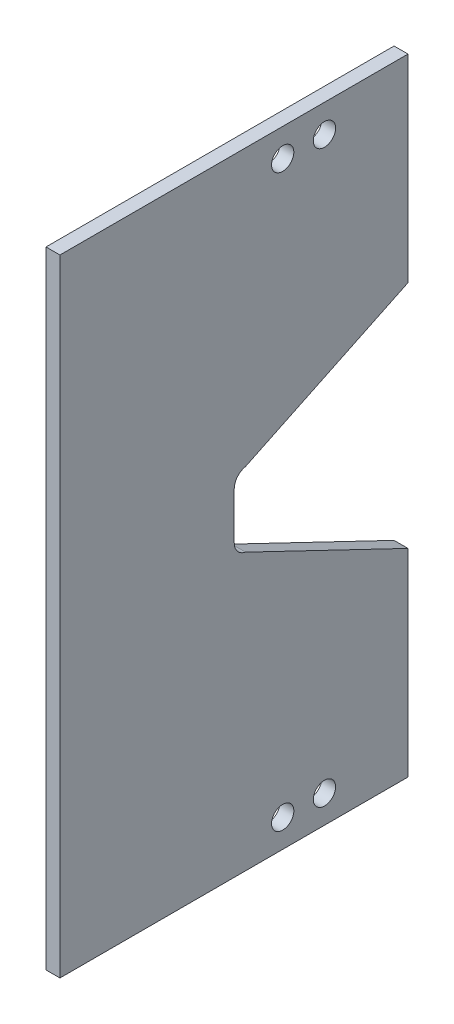
ISO-10303-21;
HEADER;
FILE_DESCRIPTION(('STEP AP214'),'2;1');
FILE_NAME('part.step','',(''),(''),'','','');
FILE_SCHEMA(('AUTOMOTIVE_DESIGN { 1 0 10303 214 1 1 1 1 }'));
ENDSEC;
DATA;
#1=APPLICATION_CONTEXT('core data for automotive mechanical design processes');
#2=APPLICATION_PROTOCOL_DEFINITION('international standard','automotive_design',2000,#1);
#3=PRODUCT_CONTEXT('',#1,'mechanical');
#4=PRODUCT('Part','Part','',(#3));
#5=PRODUCT_RELATED_PRODUCT_CATEGORY('part','',(#4));
#6=PRODUCT_DEFINITION_FORMATION('','',#4);
#7=PRODUCT_DEFINITION_CONTEXT('part definition',#1,'design');
#8=PRODUCT_DEFINITION('design','',#6,#7);
#9=PRODUCT_DEFINITION_SHAPE('','',#8);
#10=(LENGTH_UNIT() NAMED_UNIT(*) SI_UNIT(.MILLI.,.METRE.));
#11=(NAMED_UNIT(*) PLANE_ANGLE_UNIT() SI_UNIT($,.RADIAN.));
#12=(NAMED_UNIT(*) SI_UNIT($,.STERADIAN.) SOLID_ANGLE_UNIT());
#13=UNCERTAINTY_MEASURE_WITH_UNIT(LENGTH_MEASURE(1.E-05),#10,'distance_accuracy_value','');
#14=(GEOMETRIC_REPRESENTATION_CONTEXT(3) GLOBAL_UNCERTAINTY_ASSIGNED_CONTEXT((#13)) GLOBAL_UNIT_ASSIGNED_CONTEXT((#10,
#11,#12)) REPRESENTATION_CONTEXT('',''));
#15=CARTESIAN_POINT('',(0.,0.,0.));
#16=DIRECTION('',(0.,0.,1.));
#17=DIRECTION('',(1.,0.,0.));
#18=AXIS2_PLACEMENT_3D('',#15,#16,#17);
#19=CARTESIAN_POINT('',(1.20625,-10.795,3.));
#20=DIRECTION('',(0.,1.,0.));
#21=DIRECTION('',(0.,0.,1.));
#22=AXIS2_PLACEMENT_3D('',#19,#20,#21);
#23=PLANE('',#22);
#24=DIRECTION('',(0.,0.,-1.));
#25=VECTOR('',#24,1.);
#26=CARTESIAN_POINT('',(-0.793750000000003,-10.795,3.));
#27=LINE('',#26,#25);
#28=CARTESIAN_POINT('',(-0.793750000000009,-10.795,25.));
#29=VERTEX_POINT('',#28);
#30=CARTESIAN_POINT('',(-0.793749999999994,-10.795,-25.));
#31=VERTEX_POINT('',#30);
#32=EDGE_CURVE('E203',#29,#31,#27,.T.);
#33=ORIENTED_EDGE('',*,*,#32,.F.);
#34=DIRECTION('',(-1.,0.,0.));
#35=VECTOR('',#34,1.);
#36=CARTESIAN_POINT('',(1.20624999999999,-10.795,25.));
#37=LINE('',#36,#35);
#38=CARTESIAN_POINT('',(1.20624999999999,-10.795,25.));
#39=VERTEX_POINT('',#38);
#40=EDGE_CURVE('E141',#39,#29,#37,.T.);
#41=ORIENTED_EDGE('',*,*,#40,.F.);
#42=DIRECTION('',(0.,0.,-1.));
#43=VECTOR('',#42,1.);
#44=CARTESIAN_POINT('',(1.20625,-10.795,3.));
#45=LINE('',#44,#43);
#46=CARTESIAN_POINT('',(1.20625000000001,-10.795,-25.));
#47=VERTEX_POINT('',#46);
#48=EDGE_CURVE('E130',#39,#47,#45,.T.);
#49=ORIENTED_EDGE('',*,*,#48,.T.);
#50=DIRECTION('',(1.,0.,0.));
#51=VECTOR('',#50,1.);
#52=CARTESIAN_POINT('',(-0.793749999999994,-10.795,-25.));
#53=LINE('',#52,#51);
#54=EDGE_CURVE('E185',#31,#47,#53,.T.);
#55=ORIENTED_EDGE('',*,*,#54,.F.);
#56=EDGE_LOOP('',(#33,#41,#49,#55));
#57=FACE_BOUND('',#56,.T.);
#58=ADVANCED_FACE('F39',(#57),#23,.T.);
#59=CARTESIAN_POINT('',(1.20625,-100.745,3.));
#60=DIRECTION('',(0.,-1.,0.));
#61=DIRECTION('',(0.,0.,-1.));
#62=AXIS2_PLACEMENT_3D('',#59,#60,#61);
#63=PLANE('',#62);
#64=DIRECTION('',(0.,0.,1.));
#65=VECTOR('',#64,1.);
#66=CARTESIAN_POINT('',(-0.793750000000003,-100.745,3.));
#67=LINE('',#66,#65);
#68=CARTESIAN_POINT('',(-0.793749999999994,-100.745,-25.));
#69=VERTEX_POINT('',#68);
#70=CARTESIAN_POINT('',(-0.793750000000009,-100.745,25.));
#71=VERTEX_POINT('',#70);
#72=EDGE_CURVE('E211',#69,#71,#67,.T.);
#73=ORIENTED_EDGE('',*,*,#72,.F.);
#74=DIRECTION('',(1.,0.,0.));
#75=VECTOR('',#74,1.);
#76=CARTESIAN_POINT('',(-0.793749999999994,-100.745,-25.));
#77=LINE('',#76,#75);
#78=CARTESIAN_POINT('',(1.20625000000001,-100.745,-25.));
#79=VERTEX_POINT('',#78);
#80=EDGE_CURVE('E124',#69,#79,#77,.T.);
#81=ORIENTED_EDGE('',*,*,#80,.T.);
#82=DIRECTION('',(0.,0.,1.));
#83=VECTOR('',#82,1.);
#84=CARTESIAN_POINT('',(1.20625,-100.745,3.));
#85=LINE('',#84,#83);
#86=CARTESIAN_POINT('',(1.20624999999999,-100.745,25.));
#87=VERTEX_POINT('',#86);
#88=EDGE_CURVE('E118',#79,#87,#85,.T.);
#89=ORIENTED_EDGE('',*,*,#88,.T.);
#90=DIRECTION('',(-1.,0.,0.));
#91=VECTOR('',#90,1.);
#92=CARTESIAN_POINT('',(1.20624999999999,-100.745,25.));
#93=LINE('',#92,#91);
#94=EDGE_CURVE('E121',#87,#71,#93,.T.);
#95=ORIENTED_EDGE('',*,*,#94,.T.);
#96=EDGE_LOOP('',(#73,#81,#89,#95));
#97=FACE_BOUND('',#96,.T.);
#98=ADVANCED_FACE('F120',(#97),#63,.T.);
#99=CARTESIAN_POINT('',(1.20625,-55.77,-0.0391447555514948));
#100=DIRECTION('',(0.,0.,-1.));
#101=DIRECTION('',(-1.,0.,0.));
#102=AXIS2_PLACEMENT_3D('',#99,#100,#101);
#103=PLANE('',#102);
#104=DIRECTION('',(0.,-1.,0.));
#105=VECTOR('',#104,1.);
#106=CARTESIAN_POINT('',(1.20625,-55.77,-0.0391447555514948));
#107=LINE('',#106,#105);
#108=CARTESIAN_POINT('',(1.20625,-52.4114543338415,-0.039144755551495));
#109=VERTEX_POINT('',#108);
#110=CARTESIAN_POINT('',(1.20625,-59.1285456661585,-0.0391447555514946));
#111=VERTEX_POINT('',#110);
#112=EDGE_CURVE('E131',#109,#111,#107,.T.);
#113=ORIENTED_EDGE('',*,*,#112,.T.);
#114=DIRECTION('',(-1.,0.,0.));
#115=VECTOR('',#114,1.);
#116=CARTESIAN_POINT('',(-0.793750000000001,-59.1285456661585,-0.0391447555514946));
#117=LINE('',#116,#115);
#118=CARTESIAN_POINT('',(-0.793750000000002,-59.1285456661585,-0.0391447555514946));
#119=VERTEX_POINT('',#118);
#120=EDGE_CURVE('E228',#111,#119,#117,.T.);
#121=ORIENTED_EDGE('',*,*,#120,.T.);
#122=DIRECTION('',(0.,-1.,0.));
#123=VECTOR('',#122,1.);
#124=CARTESIAN_POINT('',(-0.793750000000002,-55.77,-0.0391447555514954));
#125=LINE('',#124,#123);
#126=CARTESIAN_POINT('',(-0.793750000000002,-52.4114543338415,-0.0391447555514961));
#127=VERTEX_POINT('',#126);
#128=EDGE_CURVE('E200',#127,#119,#125,.T.);
#129=ORIENTED_EDGE('',*,*,#128,.F.);
#130=DIRECTION('',(-1.,0.,0.));
#131=VECTOR('',#130,1.);
#132=CARTESIAN_POINT('',(1.20625,-52.4114543338415,-0.0391447555514955));
#133=LINE('',#132,#131);
#134=EDGE_CURVE('E219',#127,#109,#133,.F.);
#135=ORIENTED_EDGE('',*,*,#134,.T.);
#136=EDGE_LOOP('',(#113,#121,#129,#135));
#137=FACE_BOUND('',#136,.T.);
#138=ADVANCED_FACE('F281',(#137),#103,.T.);
#139=CARTESIAN_POINT('',(1.20625,-12.795,-13.));
#140=DIRECTION('',(-1.,0.,0.));
#141=DIRECTION('',(0.,0.,1.));
#142=AXIS2_PLACEMENT_3D('',#139,#140,#141);
#143=PLANE('',#142);
#144=CARTESIAN_POINT('',(1.20625,-14.795,-7.));
#145=DIRECTION('',(1.,0.,0.));
#146=DIRECTION('',(0.,0.,1.));
#147=AXIS2_PLACEMENT_3D('',#144,#145,#146);
#148=CIRCLE('',#147,1.6);
#149=CARTESIAN_POINT('',(1.20625,-14.795,-5.4));
#150=VERTEX_POINT('',#149);
#151=EDGE_CURVE('E159',#150,#150,#148,.T.);
#152=ORIENTED_EDGE('',*,*,#151,.F.);
#153=EDGE_LOOP('',(#152));
#154=FACE_BOUND('',#153,.T.);
#155=CARTESIAN_POINT('',(1.20625,-96.745,-13.));
#156=DIRECTION('',(1.,0.,0.));
#157=DIRECTION('',(0.,0.,1.));
#158=AXIS2_PLACEMENT_3D('',#155,#156,#157);
#159=CIRCLE('',#158,1.6);
#160=CARTESIAN_POINT('',(1.20625,-96.745,-11.4));
#161=VERTEX_POINT('',#160);
#162=EDGE_CURVE('E158',#161,#161,#159,.T.);
#163=ORIENTED_EDGE('',*,*,#162,.F.);
#164=EDGE_LOOP('',(#163));
#165=FACE_BOUND('',#164,.T.);
#166=CARTESIAN_POINT('',(1.20625,-96.745,-7.));
#167=DIRECTION('',(1.,0.,0.));
#168=DIRECTION('',(0.,0.,-1.));
#169=AXIS2_PLACEMENT_3D('',#166,#167,#168);
#170=CIRCLE('',#169,1.6);
#171=CARTESIAN_POINT('',(1.20625,-96.745,-8.6));
#172=VERTEX_POINT('',#171);
#173=EDGE_CURVE('E153',#172,#172,#170,.T.);
#174=ORIENTED_EDGE('',*,*,#173,.F.);
#175=EDGE_LOOP('',(#174));
#176=FACE_BOUND('',#175,.T.);
#177=CARTESIAN_POINT('',(1.20625,-14.795,-13.));
#178=DIRECTION('',(1.,0.,0.));
#179=DIRECTION('',(0.,0.,-1.));
#180=AXIS2_PLACEMENT_3D('',#177,#178,#179);
#181=CIRCLE('',#180,1.6);
#182=CARTESIAN_POINT('',(1.20625,-14.795,-14.6));
#183=VERTEX_POINT('',#182);
#184=EDGE_CURVE('E163',#183,#183,#181,.T.);
#185=ORIENTED_EDGE('',*,*,#184,.F.);
#186=EDGE_LOOP('',(#185));
#187=FACE_BOUND('',#186,.T.);
#188=CARTESIAN_POINT('',(1.20625,-52.4114543338415,-2.0391447555515));
#189=DIRECTION('',(-1.,0.,0.));
#190=DIRECTION('',(0.,0.,1.));
#191=AXIS2_PLACEMENT_3D('',#188,#189,#190);
#192=CIRCLE('',#191,2.);
#193=CARTESIAN_POINT('',(1.20625,-50.4498612190227,-1.64907751532796));
#194=VERTEX_POINT('',#193);
#195=EDGE_CURVE('E225',#109,#194,#192,.T.);
#196=ORIENTED_EDGE('',*,*,#195,.T.);
#197=DIRECTION('',(0.,-0.432718299890711,0.901529185850182));
#198=VECTOR('',#197,1.);
#199=CARTESIAN_POINT('',(1.20625,-50.4498612190227,-1.64907751532796));
#200=LINE('',#199,#198);
#201=CARTESIAN_POINT('',(1.20625000000001,-39.2418253206417,-25.));
#202=VERTEX_POINT('',#201);
#203=EDGE_CURVE('E171',#202,#194,#200,.T.);
#204=ORIENTED_EDGE('',*,*,#203,.F.);
#205=DIRECTION('',(0.,1.,0.));
#206=VECTOR('',#205,1.);
#207=CARTESIAN_POINT('',(1.20625000000001,-45.8064773177129,-25.));
#208=LINE('',#207,#206);
#209=EDGE_CURVE('E181',#202,#47,#208,.T.);
#210=ORIENTED_EDGE('',*,*,#209,.T.);
#211=ORIENTED_EDGE('',*,*,#48,.F.);
#212=DIRECTION('',(0.,1.,0.));
#213=VECTOR('',#212,1.);
#214=CARTESIAN_POINT('',(1.20624999999999,-10.795,25.));
#215=LINE('',#214,#213);
#216=EDGE_CURVE('E137',#87,#39,#215,.T.);
#217=ORIENTED_EDGE('',*,*,#216,.F.);
#218=ORIENTED_EDGE('',*,*,#88,.F.);
#219=DIRECTION('',(0.,1.,0.));
#220=VECTOR('',#219,1.);
#221=CARTESIAN_POINT('',(1.20625000000001,-65.7335226822871,-25.));
#222=LINE('',#221,#220);
#223=CARTESIAN_POINT('',(1.20625000000001,-72.2981746793583,-25.));
#224=VERTEX_POINT('',#223);
#225=EDGE_CURVE('E191',#79,#224,#222,.T.);
#226=ORIENTED_EDGE('',*,*,#225,.T.);
#227=DIRECTION('',(0.,-0.432718299890711,-0.901529185850182));
#228=VECTOR('',#227,1.);
#229=CARTESIAN_POINT('',(1.20625,-61.0901387809773,-1.64907751532796));
#230=LINE('',#229,#228);
#231=CARTESIAN_POINT('',(1.20625,-61.0901387809773,-1.64907751532796));
#232=VERTEX_POINT('',#231);
#233=EDGE_CURVE('E56',#232,#224,#230,.T.);
#234=ORIENTED_EDGE('',*,*,#233,.F.);
#235=CARTESIAN_POINT('',(1.20625,-59.1285456661585,-2.03914475555149));
#236=DIRECTION('',(-1.,0.,0.));
#237=DIRECTION('',(0.,0.,1.));
#238=AXIS2_PLACEMENT_3D('',#235,#236,#237);
#239=CIRCLE('',#238,2.);
#240=EDGE_CURVE('E239',#232,#111,#239,.T.);
#241=ORIENTED_EDGE('',*,*,#240,.T.);
#242=ORIENTED_EDGE('',*,*,#112,.F.);
#243=EDGE_LOOP('',(#196,#204,#210,#211,#217,#218,#226,#234,#241,#242));
#244=FACE_BOUND('',#243,.T.);
#245=ADVANCED_FACE('F144',(#154,#165,#176,#187,#244),#143,.F.);
#246=CARTESIAN_POINT('',(-0.793749999999998,-12.795,-13.));
#247=DIRECTION('',(-1.,0.,0.));
#248=DIRECTION('',(0.,0.,1.));
#249=AXIS2_PLACEMENT_3D('',#246,#247,#248);
#250=PLANE('',#249);
#251=CARTESIAN_POINT('',(-0.793749999999999,-14.795,-7.));
#252=DIRECTION('',(-1.,0.,0.));
#253=DIRECTION('',(0.,0.,1.));
#254=AXIS2_PLACEMENT_3D('',#251,#252,#253);
#255=CIRCLE('',#254,1.6);
#256=CARTESIAN_POINT('',(-0.79375,-14.795,-5.4));
#257=VERTEX_POINT('',#256);
#258=EDGE_CURVE('E43',#257,#257,#255,.T.);
#259=ORIENTED_EDGE('',*,*,#258,.F.);
#260=EDGE_LOOP('',(#259));
#261=FACE_BOUND('',#260,.T.);
#262=CARTESIAN_POINT('',(-0.793749999999998,-96.745,-13.));
#263=DIRECTION('',(-1.,0.,0.));
#264=DIRECTION('',(0.,0.,1.));
#265=AXIS2_PLACEMENT_3D('',#262,#263,#264);
#266=CIRCLE('',#265,1.6);
#267=CARTESIAN_POINT('',(-0.793749999999998,-96.745,-11.4));
#268=VERTEX_POINT('',#267);
#269=EDGE_CURVE('E250',#268,#268,#266,.T.);
#270=ORIENTED_EDGE('',*,*,#269,.F.);
#271=EDGE_LOOP('',(#270));
#272=FACE_BOUND('',#271,.T.);
#273=CARTESIAN_POINT('',(-0.793749999999999,-96.745,-7.));
#274=DIRECTION('',(-1.,0.,0.));
#275=DIRECTION('',(0.,0.,1.));
#276=AXIS2_PLACEMENT_3D('',#273,#274,#275);
#277=CIRCLE('',#276,1.6);
#278=CARTESIAN_POINT('',(-0.79375,-96.745,-5.4));
#279=VERTEX_POINT('',#278);
#280=EDGE_CURVE('E247',#279,#279,#277,.T.);
#281=ORIENTED_EDGE('',*,*,#280,.F.);
#282=EDGE_LOOP('',(#281));
#283=FACE_BOUND('',#282,.T.);
#284=CARTESIAN_POINT('',(-0.793749999999998,-14.795,-13.));
#285=DIRECTION('',(-1.,0.,0.));
#286=DIRECTION('',(0.,0.,1.));
#287=AXIS2_PLACEMENT_3D('',#284,#285,#286);
#288=CIRCLE('',#287,1.6);
#289=CARTESIAN_POINT('',(-0.793749999999998,-14.795,-11.4));
#290=VERTEX_POINT('',#289);
#291=EDGE_CURVE('E170',#290,#290,#288,.T.);
#292=ORIENTED_EDGE('',*,*,#291,.F.);
#293=EDGE_LOOP('',(#292));
#294=FACE_BOUND('',#293,.T.);
#295=DIRECTION('',(0.,0.432718299890711,-0.901529185850183));
#296=VECTOR('',#295,1.);
#297=CARTESIAN_POINT('',(-0.793749999999994,-38.9710842723718,-25.5640643274959));
#298=LINE('',#297,#296);
#299=CARTESIAN_POINT('',(-0.793750000000001,-50.4498612190227,-1.64907751532796));
#300=VERTEX_POINT('',#299);
#301=CARTESIAN_POINT('',(-0.793749999999994,-39.2418253206417,-25.));
#302=VERTEX_POINT('',#301);
#303=EDGE_CURVE('E64',#300,#302,#298,.T.);
#304=ORIENTED_EDGE('',*,*,#303,.F.);
#305=CARTESIAN_POINT('',(-0.793750000000001,-52.4114543338415,-2.0391447555515));
#306=DIRECTION('',(-1.,0.,0.));
#307=DIRECTION('',(0.,0.,1.));
#308=AXIS2_PLACEMENT_3D('',#305,#306,#307);
#309=CIRCLE('',#308,2.);
#310=EDGE_CURVE('E222',#300,#127,#309,.F.);
#311=ORIENTED_EDGE('',*,*,#310,.T.);
#312=ORIENTED_EDGE('',*,*,#128,.T.);
#313=CARTESIAN_POINT('',(-0.793750000000001,-59.1285456661585,-2.03914475555149));
#314=DIRECTION('',(-1.,0.,0.));
#315=DIRECTION('',(0.,0.,1.));
#316=AXIS2_PLACEMENT_3D('',#313,#314,#315);
#317=CIRCLE('',#316,2.);
#318=CARTESIAN_POINT('',(-0.793750000000001,-61.0901387809773,-1.64907751532796));
#319=VERTEX_POINT('',#318);
#320=EDGE_CURVE('E235',#119,#319,#317,.F.);
#321=ORIENTED_EDGE('',*,*,#320,.T.);
#322=DIRECTION('',(0.,0.432718299890711,0.901529185850183));
#323=VECTOR('',#322,1.);
#324=CARTESIAN_POINT('',(-0.793750000000004,-56.4751970567948,7.96573345152744));
#325=LINE('',#324,#323);
#326=CARTESIAN_POINT('',(-0.793749999999994,-72.2981746793583,-25.));
#327=VERTEX_POINT('',#326);
#328=EDGE_CURVE('E178',#327,#319,#325,.T.);
#329=ORIENTED_EDGE('',*,*,#328,.F.);
#330=DIRECTION('',(0.,1.,0.));
#331=VECTOR('',#330,1.);
#332=CARTESIAN_POINT('',(-0.793749999999994,-65.7335226822871,-25.));
#333=LINE('',#332,#331);
#334=EDGE_CURVE('E192',#69,#327,#333,.T.);
#335=ORIENTED_EDGE('',*,*,#334,.F.);
#336=ORIENTED_EDGE('',*,*,#72,.T.);
#337=DIRECTION('',(0.,1.,0.));
#338=VECTOR('',#337,1.);
#339=CARTESIAN_POINT('',(-0.793750000000009,-10.795,25.));
#340=LINE('',#339,#338);
#341=EDGE_CURVE('E139',#71,#29,#340,.T.);
#342=ORIENTED_EDGE('',*,*,#341,.T.);
#343=ORIENTED_EDGE('',*,*,#32,.T.);
#344=DIRECTION('',(0.,1.,0.));
#345=VECTOR('',#344,1.);
#346=CARTESIAN_POINT('',(-0.793749999999994,-45.8064773177129,-25.));
#347=LINE('',#346,#345);
#348=EDGE_CURVE('E182',#302,#31,#347,.T.);
#349=ORIENTED_EDGE('',*,*,#348,.F.);
#350=EDGE_LOOP('',(#304,#311,#312,#321,#329,#335,#336,#342,#343,#349));
#351=FACE_BOUND('',#350,.T.);
#352=ADVANCED_FACE('F262',(#261,#272,#283,#294,#351),#250,.T.);
#353=CARTESIAN_POINT('',(1.20625,-52.4114543338415,-2.0391447555515));
#354=DIRECTION('',(1.,0.,0.));
#355=DIRECTION('',(0.,0.,-1.));
#356=AXIS2_PLACEMENT_3D('',#353,#354,#355);
#357=CYLINDRICAL_SURFACE('',#356,2.);
#358=ORIENTED_EDGE('',*,*,#195,.F.);
#359=ORIENTED_EDGE('',*,*,#134,.F.);
#360=ORIENTED_EDGE('',*,*,#310,.F.);
#361=DIRECTION('',(-1.,0.,0.));
#362=VECTOR('',#361,1.);
#363=CARTESIAN_POINT('',(-0.793750000000001,-50.4498612190227,-1.64907751532796));
#364=LINE('',#363,#362);
#365=EDGE_CURVE('E207',#194,#300,#364,.T.);
#366=ORIENTED_EDGE('',*,*,#365,.F.);
#367=EDGE_LOOP('',(#358,#359,#360,#366));
#368=FACE_BOUND('',#367,.T.);
#369=ADVANCED_FACE('F265',(#368),#357,.F.);
#370=CARTESIAN_POINT('',(1.20625,-59.1285456661585,-2.03914475555149));
#371=DIRECTION('',(1.,0.,0.));
#372=DIRECTION('',(0.,0.,-1.));
#373=AXIS2_PLACEMENT_3D('',#370,#371,#372);
#374=CYLINDRICAL_SURFACE('',#373,2.);
#375=ORIENTED_EDGE('',*,*,#240,.F.);
#376=DIRECTION('',(-1.,0.,0.));
#377=VECTOR('',#376,1.);
#378=CARTESIAN_POINT('',(1.20625,-61.0901387809773,-1.64907751532796));
#379=LINE('',#378,#377);
#380=EDGE_CURVE('E232',#319,#232,#379,.F.);
#381=ORIENTED_EDGE('',*,*,#380,.F.);
#382=ORIENTED_EDGE('',*,*,#320,.F.);
#383=ORIENTED_EDGE('',*,*,#120,.F.);
#384=EDGE_LOOP('',(#375,#381,#382,#383));
#385=FACE_BOUND('',#384,.T.);
#386=ADVANCED_FACE('F41',(#385),#374,.F.);
#387=CARTESIAN_POINT('',(-0.793749999999994,-65.7335226822871,-25.));
#388=DIRECTION('',(0.,0.,-1.));
#389=DIRECTION('',(-1.,0.,0.));
#390=AXIS2_PLACEMENT_3D('',#387,#388,#389);
#391=PLANE('',#390);
#392=DIRECTION('',(-1.,0.,0.));
#393=VECTOR('',#392,1.);
#394=CARTESIAN_POINT('',(-0.793749999999994,-72.2981746793583,-25.));
#395=LINE('',#394,#393);
#396=EDGE_CURVE('E11',#224,#327,#395,.T.);
#397=ORIENTED_EDGE('',*,*,#396,.F.);
#398=ORIENTED_EDGE('',*,*,#225,.F.);
#399=ORIENTED_EDGE('',*,*,#80,.F.);
#400=ORIENTED_EDGE('',*,*,#334,.T.);
#401=EDGE_LOOP('',(#397,#398,#399,#400));
#402=FACE_BOUND('',#401,.T.);
#403=ADVANCED_FACE('F290',(#402),#391,.T.);
#404=CARTESIAN_POINT('',(-0.793749999999994,-45.8064773177129,-25.));
#405=DIRECTION('',(0.,0.,-1.));
#406=DIRECTION('',(-1.,0.,0.));
#407=AXIS2_PLACEMENT_3D('',#404,#405,#406);
#408=PLANE('',#407);
#409=DIRECTION('',(1.,0.,0.));
#410=VECTOR('',#409,1.);
#411=CARTESIAN_POINT('',(-0.793749999999994,-39.2418253206417,-25.));
#412=LINE('',#411,#410);
#413=EDGE_CURVE('E49',#302,#202,#412,.T.);
#414=ORIENTED_EDGE('',*,*,#413,.F.);
#415=ORIENTED_EDGE('',*,*,#348,.T.);
#416=ORIENTED_EDGE('',*,*,#54,.T.);
#417=ORIENTED_EDGE('',*,*,#209,.F.);
#418=EDGE_LOOP('',(#414,#415,#416,#417));
#419=FACE_BOUND('',#418,.T.);
#420=ADVANCED_FACE('F303',(#419),#408,.T.);
#421=CARTESIAN_POINT('',(-8.79375,-50.4498612190227,-1.64907751532796));
#422=DIRECTION('',(0.,0.901529185850182,0.432718299890711));
#423=DIRECTION('',(0.,-0.432718299890711,0.901529185850183));
#424=AXIS2_PLACEMENT_3D('',#421,#422,#423);
#425=PLANE('',#424);
#426=ORIENTED_EDGE('',*,*,#303,.T.);
#427=ORIENTED_EDGE('',*,*,#413,.T.);
#428=ORIENTED_EDGE('',*,*,#203,.T.);
#429=ORIENTED_EDGE('',*,*,#365,.T.);
#430=EDGE_LOOP('',(#426,#427,#428,#429));
#431=FACE_BOUND('',#430,.T.);
#432=ADVANCED_FACE('F294',(#431),#425,.F.);
#433=CARTESIAN_POINT('',(-8.79375,-61.0901387809773,-1.64907751532796));
#434=DIRECTION('',(0.,-0.901529185850182,0.432718299890711));
#435=DIRECTION('',(0.,-0.432718299890711,-0.901529185850183));
#436=AXIS2_PLACEMENT_3D('',#433,#434,#435);
#437=PLANE('',#436);
#438=ORIENTED_EDGE('',*,*,#328,.T.);
#439=ORIENTED_EDGE('',*,*,#380,.T.);
#440=ORIENTED_EDGE('',*,*,#233,.T.);
#441=ORIENTED_EDGE('',*,*,#396,.T.);
#442=EDGE_LOOP('',(#438,#439,#440,#441));
#443=FACE_BOUND('',#442,.T.);
#444=ADVANCED_FACE('F291',(#443),#437,.F.);
#445=CARTESIAN_POINT('',(-8.79375,-14.795,-13.));
#446=DIRECTION('',(1.,0.,0.));
#447=DIRECTION('',(0.,0.,-1.));
#448=AXIS2_PLACEMENT_3D('',#445,#446,#447);
#449=CYLINDRICAL_SURFACE('',#448,1.6);
#450=ORIENTED_EDGE('',*,*,#291,.T.);
#451=EDGE_LOOP('',(#450));
#452=FACE_BOUND('',#451,.T.);
#453=ORIENTED_EDGE('',*,*,#184,.T.);
#454=EDGE_LOOP('',(#453));
#455=FACE_BOUND('',#454,.T.);
#456=ADVANCED_FACE('F293',(#452,#455),#449,.F.);
#457=CARTESIAN_POINT('',(-8.79375,-96.745,-7.));
#458=DIRECTION('',(1.,0.,0.));
#459=DIRECTION('',(0.,0.,-1.));
#460=AXIS2_PLACEMENT_3D('',#457,#458,#459);
#461=CYLINDRICAL_SURFACE('',#460,1.6);
#462=ORIENTED_EDGE('',*,*,#280,.T.);
#463=EDGE_LOOP('',(#462));
#464=FACE_BOUND('',#463,.T.);
#465=ORIENTED_EDGE('',*,*,#173,.T.);
#466=EDGE_LOOP('',(#465));
#467=FACE_BOUND('',#466,.T.);
#468=ADVANCED_FACE('F300',(#464,#467),#461,.F.);
#469=CARTESIAN_POINT('',(-8.79375,-96.745,-13.));
#470=DIRECTION('',(1.,0.,0.));
#471=DIRECTION('',(0.,0.,-1.));
#472=AXIS2_PLACEMENT_3D('',#469,#470,#471);
#473=CYLINDRICAL_SURFACE('',#472,1.6);
#474=ORIENTED_EDGE('',*,*,#269,.T.);
#475=EDGE_LOOP('',(#474));
#476=FACE_BOUND('',#475,.T.);
#477=ORIENTED_EDGE('',*,*,#162,.T.);
#478=EDGE_LOOP('',(#477));
#479=FACE_BOUND('',#478,.T.);
#480=ADVANCED_FACE('F343',(#476,#479),#473,.F.);
#481=CARTESIAN_POINT('',(-8.79375,-14.795,-7.));
#482=DIRECTION('',(1.,0.,0.));
#483=DIRECTION('',(0.,0.,-1.));
#484=AXIS2_PLACEMENT_3D('',#481,#482,#483);
#485=CYLINDRICAL_SURFACE('',#484,1.6);
#486=ORIENTED_EDGE('',*,*,#258,.T.);
#487=EDGE_LOOP('',(#486));
#488=FACE_BOUND('',#487,.T.);
#489=ORIENTED_EDGE('',*,*,#151,.T.);
#490=EDGE_LOOP('',(#489));
#491=FACE_BOUND('',#490,.T.);
#492=ADVANCED_FACE('F259',(#488,#491),#485,.F.);
#493=CARTESIAN_POINT('',(1.20624999999999,-10.795,25.));
#494=DIRECTION('',(0.,0.,1.));
#495=DIRECTION('',(1.,0.,0.));
#496=AXIS2_PLACEMENT_3D('',#493,#494,#495);
#497=PLANE('',#496);
#498=ORIENTED_EDGE('',*,*,#341,.F.);
#499=ORIENTED_EDGE('',*,*,#94,.F.);
#500=ORIENTED_EDGE('',*,*,#216,.T.);
#501=ORIENTED_EDGE('',*,*,#40,.T.);
#502=EDGE_LOOP('',(#498,#499,#500,#501));
#503=FACE_BOUND('',#502,.T.);
#504=ADVANCED_FACE('F135',(#503),#497,.T.);
#505=CLOSED_SHELL('',(#58,#98,#138,#245,#352,#369,#386,#403,#420,#432,#444,#456,#468,#480,#492,#504));
#506=MANIFOLD_SOLID_BREP('B2',#505);
#507=ADVANCED_BREP_SHAPE_REPRESENTATION('',(#18,#506),#14);
#508=SHAPE_DEFINITION_REPRESENTATION(#9,#507);
ENDSEC;
END-ISO-10303-21;
